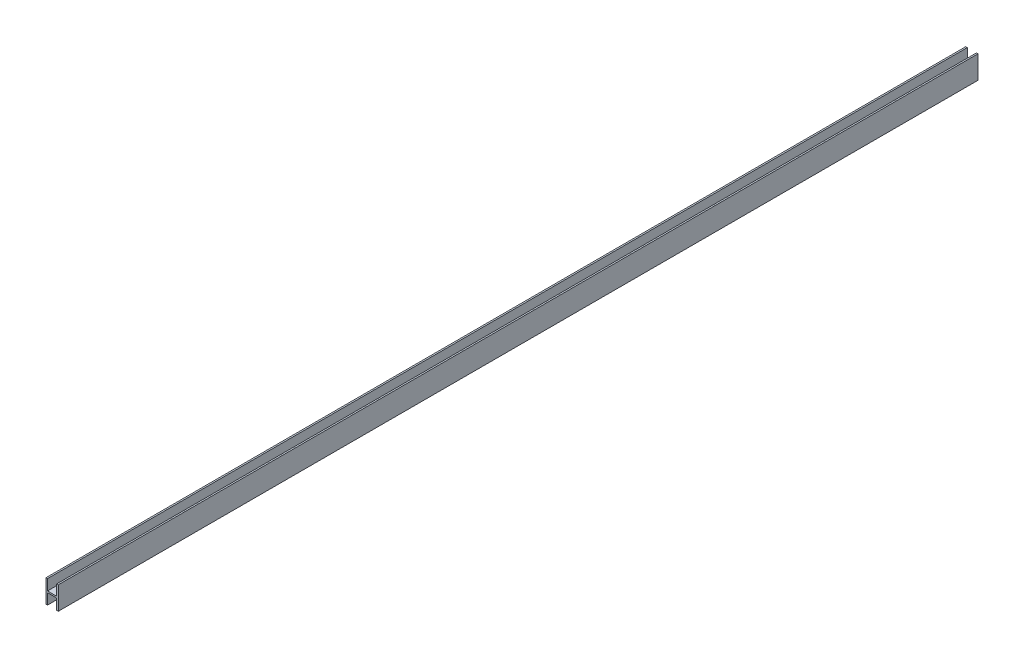
ISO-10303-21;
HEADER;
FILE_DESCRIPTION(('STEP AP214'),'2;1');
FILE_NAME('part.step','',(''),(''),'','','');
FILE_SCHEMA(('AUTOMOTIVE_DESIGN { 1 0 10303 214 1 1 1 1 }'));
ENDSEC;
DATA;
#1=APPLICATION_CONTEXT('core data for automotive mechanical design processes');
#2=APPLICATION_PROTOCOL_DEFINITION('international standard','automotive_design',2000,#1);
#3=PRODUCT_CONTEXT('',#1,'mechanical');
#4=PRODUCT('Part','Part','',(#3));
#5=PRODUCT_RELATED_PRODUCT_CATEGORY('part','',(#4));
#6=PRODUCT_DEFINITION_FORMATION('','',#4);
#7=PRODUCT_DEFINITION_CONTEXT('part definition',#1,'design');
#8=PRODUCT_DEFINITION('design','',#6,#7);
#9=PRODUCT_DEFINITION_SHAPE('','',#8);
#10=(LENGTH_UNIT() NAMED_UNIT(*) SI_UNIT(.MILLI.,.METRE.));
#11=(NAMED_UNIT(*) PLANE_ANGLE_UNIT() SI_UNIT($,.RADIAN.));
#12=(NAMED_UNIT(*) SI_UNIT($,.STERADIAN.) SOLID_ANGLE_UNIT());
#13=UNCERTAINTY_MEASURE_WITH_UNIT(LENGTH_MEASURE(1.E-05),#10,'distance_accuracy_value','');
#14=(GEOMETRIC_REPRESENTATION_CONTEXT(3) GLOBAL_UNCERTAINTY_ASSIGNED_CONTEXT((#13)) GLOBAL_UNIT_ASSIGNED_CONTEXT((#10,
#11,#12)) REPRESENTATION_CONTEXT('',''));
#15=CARTESIAN_POINT('',(0.,0.,0.));
#16=DIRECTION('',(0.,0.,1.));
#17=DIRECTION('',(1.,0.,0.));
#18=AXIS2_PLACEMENT_3D('',#15,#16,#17);
#19=CARTESIAN_POINT('',(-4.,7.5,600.));
#20=DIRECTION('',(0.,-1.,0.));
#21=DIRECTION('',(0.,0.,-1.));
#22=AXIS2_PLACEMENT_3D('',#19,#20,#21);
#23=PLANE('',#22);
#24=DIRECTION('',(-1.,0.,0.));
#25=VECTOR('',#24,1.);
#26=CARTESIAN_POINT('',(-4.,7.5,600.));
#27=LINE('',#26,#25);
#28=CARTESIAN_POINT('',(-3.,7.5,600.));
#29=VERTEX_POINT('',#28);
#30=CARTESIAN_POINT('',(-4.,7.5,600.));
#31=VERTEX_POINT('',#30);
#32=EDGE_CURVE('E182',#29,#31,#27,.T.);
#33=ORIENTED_EDGE('',*,*,#32,.F.);
#34=DIRECTION('',(0.,0.,-1.));
#35=VECTOR('',#34,1.);
#36=CARTESIAN_POINT('',(-3.,7.5,600.));
#37=LINE('',#36,#35);
#38=CARTESIAN_POINT('',(-3.,7.5,0.));
#39=VERTEX_POINT('',#38);
#40=EDGE_CURVE('E164',#29,#39,#37,.T.);
#41=ORIENTED_EDGE('',*,*,#40,.T.);
#42=DIRECTION('',(-1.,0.,0.));
#43=VECTOR('',#42,1.);
#44=CARTESIAN_POINT('',(-4.,7.5,0.));
#45=LINE('',#44,#43);
#46=CARTESIAN_POINT('',(-4.,7.5,0.));
#47=VERTEX_POINT('',#46);
#48=EDGE_CURVE('E196',#39,#47,#45,.T.);
#49=ORIENTED_EDGE('',*,*,#48,.T.);
#50=DIRECTION('',(0.,0.,-1.));
#51=VECTOR('',#50,1.);
#52=CARTESIAN_POINT('',(-4.,7.5,600.));
#53=LINE('',#52,#51);
#54=EDGE_CURVE('E209',#31,#47,#53,.T.);
#55=ORIENTED_EDGE('',*,*,#54,.F.);
#56=EDGE_LOOP('',(#33,#41,#49,#55));
#57=FACE_BOUND('',#56,.T.);
#58=ADVANCED_FACE('F34',(#57),#23,.F.);
#59=CARTESIAN_POINT('',(-4.,-7.5,600.));
#60=DIRECTION('',(0.,1.,0.));
#61=DIRECTION('',(0.,0.,1.));
#62=AXIS2_PLACEMENT_3D('',#59,#60,#61);
#63=PLANE('',#62);
#64=DIRECTION('',(1.,0.,0.));
#65=VECTOR('',#64,1.);
#66=CARTESIAN_POINT('',(-4.,-7.5,0.));
#67=LINE('',#66,#65);
#68=CARTESIAN_POINT('',(-4.,-7.5,0.));
#69=VERTEX_POINT('',#68);
#70=CARTESIAN_POINT('',(-3.,-7.5,0.));
#71=VERTEX_POINT('',#70);
#72=EDGE_CURVE('E183',#69,#71,#67,.T.);
#73=ORIENTED_EDGE('',*,*,#72,.T.);
#74=DIRECTION('',(0.,0.,1.));
#75=VECTOR('',#74,1.);
#76=CARTESIAN_POINT('',(-3.,-7.5,600.));
#77=LINE('',#76,#75);
#78=CARTESIAN_POINT('',(-3.,-7.5,600.));
#79=VERTEX_POINT('',#78);
#80=EDGE_CURVE('E175',#71,#79,#77,.T.);
#81=ORIENTED_EDGE('',*,*,#80,.T.);
#82=DIRECTION('',(1.,0.,0.));
#83=VECTOR('',#82,1.);
#84=CARTESIAN_POINT('',(-4.,-7.5,600.));
#85=LINE('',#84,#83);
#86=CARTESIAN_POINT('',(-4.,-7.5,600.));
#87=VERTEX_POINT('',#86);
#88=EDGE_CURVE('E190',#87,#79,#85,.T.);
#89=ORIENTED_EDGE('',*,*,#88,.F.);
#90=DIRECTION('',(0.,0.,-1.));
#91=VECTOR('',#90,1.);
#92=CARTESIAN_POINT('',(-4.,-7.5,600.));
#93=LINE('',#92,#91);
#94=EDGE_CURVE('E206',#87,#69,#93,.T.);
#95=ORIENTED_EDGE('',*,*,#94,.T.);
#96=EDGE_LOOP('',(#73,#81,#89,#95));
#97=FACE_BOUND('',#96,.T.);
#98=ADVANCED_FACE('F239',(#97),#63,.F.);
#99=CARTESIAN_POINT('',(4.,-7.5,600.));
#100=DIRECTION('',(-1.,0.,0.));
#101=DIRECTION('',(0.,0.,1.));
#102=AXIS2_PLACEMENT_3D('',#99,#100,#101);
#103=PLANE('',#102);
#104=DIRECTION('',(0.,1.,0.));
#105=VECTOR('',#104,1.);
#106=CARTESIAN_POINT('',(4.,-7.5,0.));
#107=LINE('',#106,#105);
#108=CARTESIAN_POINT('',(4.,-7.5,0.));
#109=VERTEX_POINT('',#108);
#110=CARTESIAN_POINT('',(4.,7.5,0.));
#111=VERTEX_POINT('',#110);
#112=EDGE_CURVE('E178',#109,#111,#107,.T.);
#113=ORIENTED_EDGE('',*,*,#112,.T.);
#114=DIRECTION('',(0.,0.,-1.));
#115=VECTOR('',#114,1.);
#116=CARTESIAN_POINT('',(4.,7.5,600.));
#117=LINE('',#116,#115);
#118=CARTESIAN_POINT('',(4.,7.5,600.));
#119=VERTEX_POINT('',#118);
#120=EDGE_CURVE('E212',#119,#111,#117,.T.);
#121=ORIENTED_EDGE('',*,*,#120,.F.);
#122=DIRECTION('',(0.,1.,0.));
#123=VECTOR('',#122,1.);
#124=CARTESIAN_POINT('',(4.,-7.5,600.));
#125=LINE('',#124,#123);
#126=CARTESIAN_POINT('',(4.,-7.5,600.));
#127=VERTEX_POINT('',#126);
#128=EDGE_CURVE('E179',#127,#119,#125,.T.);
#129=ORIENTED_EDGE('',*,*,#128,.F.);
#130=DIRECTION('',(0.,0.,-1.));
#131=VECTOR('',#130,1.);
#132=CARTESIAN_POINT('',(4.,-7.5,600.));
#133=LINE('',#132,#131);
#134=EDGE_CURVE('E193',#127,#109,#133,.T.);
#135=ORIENTED_EDGE('',*,*,#134,.T.);
#136=EDGE_LOOP('',(#113,#121,#129,#135));
#137=FACE_BOUND('',#136,.T.);
#138=ADVANCED_FACE('F36',(#137),#103,.F.);
#139=CARTESIAN_POINT('',(3.,7.5,0.));
#140=VERTEX_POINT('',#139);
#141=EDGE_CURVE('E197',#111,#140,#45,.T.);
#142=ORIENTED_EDGE('',*,*,#141,.T.);
#143=DIRECTION('',(0.,0.,1.));
#144=VECTOR('',#143,1.);
#145=CARTESIAN_POINT('',(3.,7.5,600.));
#146=LINE('',#145,#144);
#147=CARTESIAN_POINT('',(3.,7.5,600.));
#148=VERTEX_POINT('',#147);
#149=EDGE_CURVE('E56',#140,#148,#146,.T.);
#150=ORIENTED_EDGE('',*,*,#149,.T.);
#151=EDGE_CURVE('E184',#119,#148,#27,.T.);
#152=ORIENTED_EDGE('',*,*,#151,.F.);
#153=ORIENTED_EDGE('',*,*,#120,.T.);
#154=EDGE_LOOP('',(#142,#150,#152,#153));
#155=FACE_BOUND('',#154,.T.);
#156=ADVANCED_FACE('F226',(#155),#23,.F.);
#157=CARTESIAN_POINT('',(-4.,-7.5,600.));
#158=DIRECTION('',(1.,0.,0.));
#159=DIRECTION('',(0.,0.,-1.));
#160=AXIS2_PLACEMENT_3D('',#157,#158,#159);
#161=PLANE('',#160);
#162=DIRECTION('',(0.,-1.,0.));
#163=VECTOR('',#162,1.);
#164=CARTESIAN_POINT('',(-4.,-7.5,0.));
#165=LINE('',#164,#163);
#166=EDGE_CURVE('E200',#47,#69,#165,.T.);
#167=ORIENTED_EDGE('',*,*,#166,.T.);
#168=ORIENTED_EDGE('',*,*,#94,.F.);
#169=DIRECTION('',(0.,-1.,0.));
#170=VECTOR('',#169,1.);
#171=CARTESIAN_POINT('',(-4.,-7.5,600.));
#172=LINE('',#171,#170);
#173=EDGE_CURVE('E187',#31,#87,#172,.T.);
#174=ORIENTED_EDGE('',*,*,#173,.F.);
#175=ORIENTED_EDGE('',*,*,#54,.T.);
#176=EDGE_LOOP('',(#167,#168,#174,#175));
#177=FACE_BOUND('',#176,.T.);
#178=ADVANCED_FACE('F244',(#177),#161,.F.);
#179=CARTESIAN_POINT('',(3.,-7.5,600.));
#180=VERTEX_POINT('',#179);
#181=EDGE_CURVE('E189',#180,#127,#85,.T.);
#182=ORIENTED_EDGE('',*,*,#181,.F.);
#183=DIRECTION('',(0.,0.,-1.));
#184=VECTOR('',#183,1.);
#185=CARTESIAN_POINT('',(3.,-7.5,600.));
#186=LINE('',#185,#184);
#187=CARTESIAN_POINT('',(3.,-7.5,0.));
#188=VERTEX_POINT('',#187);
#189=EDGE_CURVE('E170',#180,#188,#186,.T.);
#190=ORIENTED_EDGE('',*,*,#189,.T.);
#191=EDGE_CURVE('E143',#188,#109,#67,.T.);
#192=ORIENTED_EDGE('',*,*,#191,.T.);
#193=ORIENTED_EDGE('',*,*,#134,.F.);
#194=EDGE_LOOP('',(#182,#190,#192,#193));
#195=FACE_BOUND('',#194,.T.);
#196=ADVANCED_FACE('F233',(#195),#63,.F.);
#197=CARTESIAN_POINT('',(0.,0.,600.));
#198=DIRECTION('',(0.,0.,-1.));
#199=DIRECTION('',(-1.,0.,0.));
#200=AXIS2_PLACEMENT_3D('',#197,#198,#199);
#201=PLANE('',#200);
#202=ORIENTED_EDGE('',*,*,#88,.T.);
#203=DIRECTION('',(0.,1.,0.));
#204=VECTOR('',#203,1.);
#205=CARTESIAN_POINT('',(-3.,0.,600.));
#206=LINE('',#205,#204);
#207=CARTESIAN_POINT('',(-3.,-0.5,600.));
#208=VERTEX_POINT('',#207);
#209=EDGE_CURVE('E172',#79,#208,#206,.T.);
#210=ORIENTED_EDGE('',*,*,#209,.T.);
#211=DIRECTION('',(1.,0.,0.));
#212=VECTOR('',#211,1.);
#213=CARTESIAN_POINT('',(0.,-0.5,600.));
#214=LINE('',#213,#212);
#215=CARTESIAN_POINT('',(3.,-0.5,600.));
#216=VERTEX_POINT('',#215);
#217=EDGE_CURVE('E167',#208,#216,#214,.T.);
#218=ORIENTED_EDGE('',*,*,#217,.T.);
#219=DIRECTION('',(0.,-1.,0.));
#220=VECTOR('',#219,1.);
#221=CARTESIAN_POINT('',(3.,0.,600.));
#222=LINE('',#221,#220);
#223=EDGE_CURVE('E129',#216,#180,#222,.T.);
#224=ORIENTED_EDGE('',*,*,#223,.T.);
#225=ORIENTED_EDGE('',*,*,#181,.T.);
#226=ORIENTED_EDGE('',*,*,#128,.T.);
#227=ORIENTED_EDGE('',*,*,#151,.T.);
#228=DIRECTION('',(0.,-1.,0.));
#229=VECTOR('',#228,1.);
#230=CARTESIAN_POINT('',(3.,0.,600.));
#231=LINE('',#230,#229);
#232=CARTESIAN_POINT('',(3.,0.5,600.));
#233=VERTEX_POINT('',#232);
#234=EDGE_CURVE('E131',#148,#233,#231,.T.);
#235=ORIENTED_EDGE('',*,*,#234,.T.);
#236=DIRECTION('',(-1.,0.,0.));
#237=VECTOR('',#236,1.);
#238=CARTESIAN_POINT('',(0.,0.5,600.));
#239=LINE('',#238,#237);
#240=CARTESIAN_POINT('',(-3.,0.5,600.));
#241=VERTEX_POINT('',#240);
#242=EDGE_CURVE('E158',#233,#241,#239,.T.);
#243=ORIENTED_EDGE('',*,*,#242,.T.);
#244=DIRECTION('',(0.,1.,0.));
#245=VECTOR('',#244,1.);
#246=CARTESIAN_POINT('',(-3.,0.,600.));
#247=LINE('',#246,#245);
#248=EDGE_CURVE('E161',#241,#29,#247,.T.);
#249=ORIENTED_EDGE('',*,*,#248,.T.);
#250=ORIENTED_EDGE('',*,*,#32,.T.);
#251=ORIENTED_EDGE('',*,*,#173,.T.);
#252=EDGE_LOOP('',(#202,#210,#218,#224,#225,#226,#227,#235,#243,#249,#250,#251));
#253=FACE_BOUND('',#252,.T.);
#254=ADVANCED_FACE('F223',(#253),#201,.F.);
#255=CARTESIAN_POINT('',(0.,0.,0.));
#256=DIRECTION('',(0.,0.,-1.));
#257=DIRECTION('',(-1.,0.,0.));
#258=AXIS2_PLACEMENT_3D('',#255,#256,#257);
#259=PLANE('',#258);
#260=DIRECTION('',(0.,1.,0.));
#261=VECTOR('',#260,1.);
#262=CARTESIAN_POINT('',(-3.,0.,0.));
#263=LINE('',#262,#261);
#264=CARTESIAN_POINT('',(-3.,-0.5,0.));
#265=VERTEX_POINT('',#264);
#266=EDGE_CURVE('E11',#71,#265,#263,.T.);
#267=ORIENTED_EDGE('',*,*,#266,.F.);
#268=ORIENTED_EDGE('',*,*,#72,.F.);
#269=ORIENTED_EDGE('',*,*,#166,.F.);
#270=ORIENTED_EDGE('',*,*,#48,.F.);
#271=DIRECTION('',(0.,1.,0.));
#272=VECTOR('',#271,1.);
#273=CARTESIAN_POINT('',(-3.,0.5,0.));
#274=LINE('',#273,#272);
#275=CARTESIAN_POINT('',(-3.,0.5,0.));
#276=VERTEX_POINT('',#275);
#277=EDGE_CURVE('E147',#276,#39,#274,.T.);
#278=ORIENTED_EDGE('',*,*,#277,.F.);
#279=DIRECTION('',(-1.,0.,0.));
#280=VECTOR('',#279,1.);
#281=CARTESIAN_POINT('',(3.,0.5,0.));
#282=LINE('',#281,#280);
#283=CARTESIAN_POINT('',(3.,0.5,0.));
#284=VERTEX_POINT('',#283);
#285=EDGE_CURVE('E149',#284,#276,#282,.T.);
#286=ORIENTED_EDGE('',*,*,#285,.F.);
#287=DIRECTION('',(0.,-1.,0.));
#288=VECTOR('',#287,1.);
#289=CARTESIAN_POINT('',(3.,0.,0.));
#290=LINE('',#289,#288);
#291=EDGE_CURVE('E42',#140,#284,#290,.T.);
#292=ORIENTED_EDGE('',*,*,#291,.F.);
#293=ORIENTED_EDGE('',*,*,#141,.F.);
#294=ORIENTED_EDGE('',*,*,#112,.F.);
#295=ORIENTED_EDGE('',*,*,#191,.F.);
#296=DIRECTION('',(0.,-1.,0.));
#297=VECTOR('',#296,1.);
#298=CARTESIAN_POINT('',(3.,-14.5,0.));
#299=LINE('',#298,#297);
#300=CARTESIAN_POINT('',(3.,-0.5,0.));
#301=VERTEX_POINT('',#300);
#302=EDGE_CURVE('E126',#301,#188,#299,.T.);
#303=ORIENTED_EDGE('',*,*,#302,.F.);
#304=DIRECTION('',(1.,0.,0.));
#305=VECTOR('',#304,1.);
#306=CARTESIAN_POINT('',(3.,-0.5,0.));
#307=LINE('',#306,#305);
#308=EDGE_CURVE('E134',#265,#301,#307,.T.);
#309=ORIENTED_EDGE('',*,*,#308,.F.);
#310=EDGE_LOOP('',(#267,#268,#269,#270,#278,#286,#292,#293,#294,#295,#303,#309));
#311=FACE_BOUND('',#310,.T.);
#312=ADVANCED_FACE('F141',(#311),#259,.T.);
#313=CARTESIAN_POINT('',(-3.,0.5,2400.));
#314=DIRECTION('',(-1.,0.,0.));
#315=DIRECTION('',(0.,0.,1.));
#316=AXIS2_PLACEMENT_3D('',#313,#314,#315);
#317=PLANE('',#316);
#318=ORIENTED_EDGE('',*,*,#248,.F.);
#319=DIRECTION('',(0.,0.,-1.));
#320=VECTOR('',#319,1.);
#321=CARTESIAN_POINT('',(-3.,0.5,2400.));
#322=LINE('',#321,#320);
#323=EDGE_CURVE('E138',#241,#276,#322,.T.);
#324=ORIENTED_EDGE('',*,*,#323,.T.);
#325=ORIENTED_EDGE('',*,*,#277,.T.);
#326=ORIENTED_EDGE('',*,*,#40,.F.);
#327=EDGE_LOOP('',(#318,#324,#325,#326));
#328=FACE_BOUND('',#327,.T.);
#329=ADVANCED_FACE('F248',(#328),#317,.F.);
#330=CARTESIAN_POINT('',(3.,0.5,2400.));
#331=DIRECTION('',(0.,-1.,0.));
#332=DIRECTION('',(0.,0.,-1.));
#333=AXIS2_PLACEMENT_3D('',#330,#331,#332);
#334=PLANE('',#333);
#335=DIRECTION('',(0.,0.,-1.));
#336=VECTOR('',#335,1.);
#337=CARTESIAN_POINT('',(3.,0.5,2400.));
#338=LINE('',#337,#336);
#339=EDGE_CURVE('E152',#233,#284,#338,.T.);
#340=ORIENTED_EDGE('',*,*,#339,.T.);
#341=ORIENTED_EDGE('',*,*,#285,.T.);
#342=ORIENTED_EDGE('',*,*,#323,.F.);
#343=ORIENTED_EDGE('',*,*,#242,.F.);
#344=EDGE_LOOP('',(#340,#341,#342,#343));
#345=FACE_BOUND('',#344,.T.);
#346=ADVANCED_FACE('F221',(#345),#334,.F.);
#347=CARTESIAN_POINT('',(3.,0.5,2400.));
#348=DIRECTION('',(1.,0.,0.));
#349=DIRECTION('',(0.,0.,-1.));
#350=AXIS2_PLACEMENT_3D('',#347,#348,#349);
#351=PLANE('',#350);
#352=ORIENTED_EDGE('',*,*,#291,.T.);
#353=ORIENTED_EDGE('',*,*,#339,.F.);
#354=ORIENTED_EDGE('',*,*,#234,.F.);
#355=ORIENTED_EDGE('',*,*,#149,.F.);
#356=EDGE_LOOP('',(#352,#353,#354,#355));
#357=FACE_BOUND('',#356,.T.);
#358=ADVANCED_FACE('F216',(#357),#351,.F.);
#359=CARTESIAN_POINT('',(-3.,-14.5,2400.));
#360=DIRECTION('',(-1.,0.,0.));
#361=DIRECTION('',(0.,0.,1.));
#362=AXIS2_PLACEMENT_3D('',#359,#360,#361);
#363=PLANE('',#362);
#364=ORIENTED_EDGE('',*,*,#266,.T.);
#365=DIRECTION('',(0.,0.,-1.));
#366=VECTOR('',#365,1.);
#367=CARTESIAN_POINT('',(-3.,-0.5,2400.));
#368=LINE('',#367,#366);
#369=EDGE_CURVE('E49',#208,#265,#368,.T.);
#370=ORIENTED_EDGE('',*,*,#369,.F.);
#371=ORIENTED_EDGE('',*,*,#209,.F.);
#372=ORIENTED_EDGE('',*,*,#80,.F.);
#373=EDGE_LOOP('',(#364,#370,#371,#372));
#374=FACE_BOUND('',#373,.T.);
#375=ADVANCED_FACE('F235',(#374),#363,.F.);
#376=CARTESIAN_POINT('',(3.,-14.5,2400.));
#377=DIRECTION('',(1.,0.,0.));
#378=DIRECTION('',(0.,0.,-1.));
#379=AXIS2_PLACEMENT_3D('',#376,#377,#378);
#380=PLANE('',#379);
#381=ORIENTED_EDGE('',*,*,#223,.F.);
#382=DIRECTION('',(0.,0.,-1.));
#383=VECTOR('',#382,1.);
#384=CARTESIAN_POINT('',(3.,-0.5,2400.));
#385=LINE('',#384,#383);
#386=EDGE_CURVE('E123',#216,#301,#385,.T.);
#387=ORIENTED_EDGE('',*,*,#386,.T.);
#388=ORIENTED_EDGE('',*,*,#302,.T.);
#389=ORIENTED_EDGE('',*,*,#189,.F.);
#390=EDGE_LOOP('',(#381,#387,#388,#389));
#391=FACE_BOUND('',#390,.T.);
#392=ADVANCED_FACE('F124',(#391),#380,.F.);
#393=CARTESIAN_POINT('',(3.,-0.5,2400.));
#394=DIRECTION('',(0.,1.,0.));
#395=DIRECTION('',(0.,0.,1.));
#396=AXIS2_PLACEMENT_3D('',#393,#394,#395);
#397=PLANE('',#396);
#398=ORIENTED_EDGE('',*,*,#369,.T.);
#399=ORIENTED_EDGE('',*,*,#308,.T.);
#400=ORIENTED_EDGE('',*,*,#386,.F.);
#401=ORIENTED_EDGE('',*,*,#217,.F.);
#402=EDGE_LOOP('',(#398,#399,#400,#401));
#403=FACE_BOUND('',#402,.T.);
#404=ADVANCED_FACE('F135',(#403),#397,.F.);
#405=CLOSED_SHELL('',(#58,#98,#138,#156,#178,#196,#254,#312,#329,#346,#358,#375,#392,#404));
#406=MANIFOLD_SOLID_BREP('B2',#405);
#407=ADVANCED_BREP_SHAPE_REPRESENTATION('',(#18,#406),#14);
#408=SHAPE_DEFINITION_REPRESENTATION(#9,#407);
ENDSEC;
END-ISO-10303-21;
